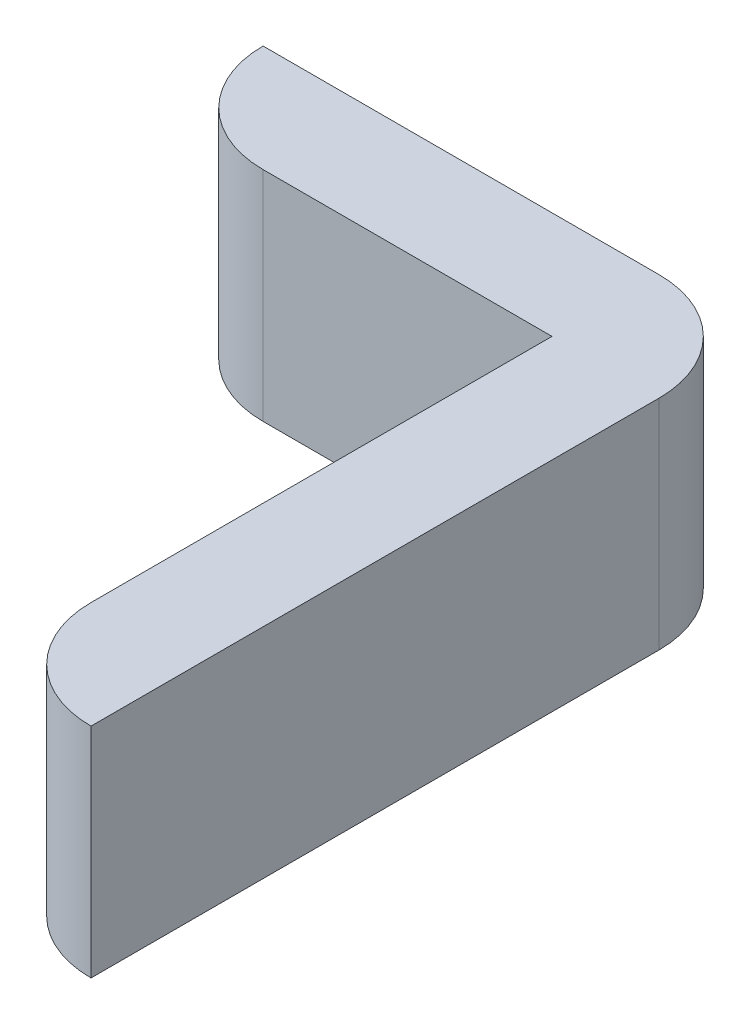
ISO-10303-21;
HEADER;
FILE_DESCRIPTION(('STEP AP214'),'2;1');
FILE_NAME('part.step','',(''),(''),'','','');
FILE_SCHEMA(('AUTOMOTIVE_DESIGN { 1 0 10303 214 1 1 1 1 }'));
ENDSEC;
DATA;
#1=APPLICATION_CONTEXT('core data for automotive mechanical design processes');
#2=APPLICATION_PROTOCOL_DEFINITION('international standard','automotive_design',2000,#1);
#3=PRODUCT_CONTEXT('',#1,'mechanical');
#4=PRODUCT('Part','Part','',(#3));
#5=PRODUCT_RELATED_PRODUCT_CATEGORY('part','',(#4));
#6=PRODUCT_DEFINITION_FORMATION('','',#4);
#7=PRODUCT_DEFINITION_CONTEXT('part definition',#1,'design');
#8=PRODUCT_DEFINITION('design','',#6,#7);
#9=PRODUCT_DEFINITION_SHAPE('','',#8);
#10=(LENGTH_UNIT() NAMED_UNIT(*) SI_UNIT(.MILLI.,.METRE.));
#11=(NAMED_UNIT(*) PLANE_ANGLE_UNIT() SI_UNIT($,.RADIAN.));
#12=(NAMED_UNIT(*) SI_UNIT($,.STERADIAN.) SOLID_ANGLE_UNIT());
#13=UNCERTAINTY_MEASURE_WITH_UNIT(LENGTH_MEASURE(1.E-05),#10,'distance_accuracy_value','');
#14=(GEOMETRIC_REPRESENTATION_CONTEXT(3) GLOBAL_UNCERTAINTY_ASSIGNED_CONTEXT((#13)) GLOBAL_UNIT_ASSIGNED_CONTEXT((#10,
#11,#12)) REPRESENTATION_CONTEXT('',''));
#15=CARTESIAN_POINT('',(0.,0.,0.));
#16=DIRECTION('',(0.,0.,1.));
#17=DIRECTION('',(1.,0.,0.));
#18=AXIS2_PLACEMENT_3D('',#15,#16,#17);
#19=CARTESIAN_POINT('',(9.275,-6.0952,0.));
#20=DIRECTION('',(0.,-1.,0.));
#21=DIRECTION('',(0.,0.,-1.));
#22=AXIS2_PLACEMENT_3D('',#19,#20,#21);
#23=PLANE('',#22);
#24=DIRECTION('',(-1.,0.,0.));
#25=VECTOR('',#24,1.);
#26=CARTESIAN_POINT('',(9.525,-6.0952,0.25));
#27=LINE('',#26,#25);
#28=CARTESIAN_POINT('',(9.525,-6.0952,0.25));
#29=VERTEX_POINT('',#28);
#30=CARTESIAN_POINT('',(10.2,-6.0952,0.25));
#31=VERTEX_POINT('',#30);
#32=EDGE_CURVE('E102',#29,#31,#27,.F.);
#33=ORIENTED_EDGE('',*,*,#32,.T.);
#34=DIRECTION('',(0.,0.,-1.));
#35=VECTOR('',#34,1.);
#36=CARTESIAN_POINT('',(10.2,-6.0952,0.25));
#37=LINE('',#36,#35);
#38=CARTESIAN_POINT('',(10.2,-6.0952,1.327));
#39=VERTEX_POINT('',#38);
#40=EDGE_CURVE('E108',#31,#39,#37,.F.);
#41=ORIENTED_EDGE('',*,*,#40,.T.);
#42=CARTESIAN_POINT('',(10.45,-6.0952,1.327));
#43=DIRECTION('',(0.,-1.,0.));
#44=DIRECTION('',(0.,0.,-1.));
#45=AXIS2_PLACEMENT_3D('',#42,#43,#44);
#46=CIRCLE('',#45,0.25);
#47=CARTESIAN_POINT('',(10.45,-6.0952,1.577));
#48=VERTEX_POINT('',#47);
#49=EDGE_CURVE('E80',#48,#39,#46,.T.);
#50=ORIENTED_EDGE('',*,*,#49,.F.);
#51=DIRECTION('',(0.,0.,1.));
#52=VECTOR('',#51,1.);
#53=CARTESIAN_POINT('',(10.45,-6.0952,1.577));
#54=LINE('',#53,#52);
#55=CARTESIAN_POINT('',(10.45,-6.0952,0.25));
#56=VERTEX_POINT('',#55);
#57=EDGE_CURVE('E75',#48,#56,#54,.F.);
#58=ORIENTED_EDGE('',*,*,#57,.T.);
#59=CARTESIAN_POINT('',(10.2,-6.0952,0.25));
#60=DIRECTION('',(0.,-1.,0.));
#61=DIRECTION('',(0.,0.,-1.));
#62=AXIS2_PLACEMENT_3D('',#59,#60,#61);
#63=CIRCLE('',#62,0.25);
#64=CARTESIAN_POINT('',(10.2,-6.0952,0.));
#65=VERTEX_POINT('',#64);
#66=EDGE_CURVE('E19',#65,#56,#63,.T.);
#67=ORIENTED_EDGE('',*,*,#66,.F.);
#68=DIRECTION('',(1.,0.,0.));
#69=VECTOR('',#68,1.);
#70=CARTESIAN_POINT('',(10.2,-6.0952,0.));
#71=LINE('',#70,#69);
#72=CARTESIAN_POINT('',(9.275,-6.0952,0.));
#73=VERTEX_POINT('',#72);
#74=EDGE_CURVE('E70',#65,#73,#71,.F.);
#75=ORIENTED_EDGE('',*,*,#74,.T.);
#76=CARTESIAN_POINT('',(9.525,-6.0952,0.));
#77=DIRECTION('',(0.,-1.,0.));
#78=DIRECTION('',(0.,0.,-1.));
#79=AXIS2_PLACEMENT_3D('',#76,#77,#78);
#80=CIRCLE('',#79,0.25);
#81=EDGE_CURVE('E121',#29,#73,#80,.T.);
#82=ORIENTED_EDGE('',*,*,#81,.F.);
#83=EDGE_LOOP('',(#33,#41,#50,#58,#67,#75,#82));
#84=FACE_BOUND('',#83,.T.);
#85=ADVANCED_FACE('F16',(#84),#23,.F.);
#86=CARTESIAN_POINT('',(10.2,-6.6048,0.));
#87=DIRECTION('',(0.,0.,1.));
#88=DIRECTION('',(1.,0.,0.));
#89=AXIS2_PLACEMENT_3D('',#86,#87,#88);
#90=PLANE('',#89);
#91=DIRECTION('',(0.,-1.,0.));
#92=VECTOR('',#91,1.);
#93=CARTESIAN_POINT('',(9.275,-6.6048,0.));
#94=LINE('',#93,#92);
#95=CARTESIAN_POINT('',(9.275,-6.6048,0.));
#96=VERTEX_POINT('',#95);
#97=EDGE_CURVE('E123',#73,#96,#94,.T.);
#98=ORIENTED_EDGE('',*,*,#97,.F.);
#99=ORIENTED_EDGE('',*,*,#74,.F.);
#100=DIRECTION('',(0.,-1.,0.));
#101=VECTOR('',#100,1.);
#102=CARTESIAN_POINT('',(10.2,-6.6048,0.));
#103=LINE('',#102,#101);
#104=CARTESIAN_POINT('',(10.2,-6.6048,0.));
#105=VERTEX_POINT('',#104);
#106=EDGE_CURVE('E92',#105,#65,#103,.F.);
#107=ORIENTED_EDGE('',*,*,#106,.F.);
#108=DIRECTION('',(1.,0.,0.));
#109=VECTOR('',#108,1.);
#110=CARTESIAN_POINT('',(9.275,-6.6048,0.));
#111=LINE('',#110,#109);
#112=EDGE_CURVE('E120',#96,#105,#111,.T.);
#113=ORIENTED_EDGE('',*,*,#112,.F.);
#114=EDGE_LOOP('',(#98,#99,#107,#113));
#115=FACE_BOUND('',#114,.T.);
#116=ADVANCED_FACE('F158',(#115),#90,.F.);
#117=CARTESIAN_POINT('',(10.2,-6.6048,0.25));
#118=DIRECTION('',(0.,-1.,0.));
#119=DIRECTION('',(0.,0.,-1.));
#120=AXIS2_PLACEMENT_3D('',#117,#118,#119);
#121=CYLINDRICAL_SURFACE('',#120,0.25);
#122=ORIENTED_EDGE('',*,*,#66,.T.);
#123=DIRECTION('',(0.,1.,0.));
#124=VECTOR('',#123,1.);
#125=CARTESIAN_POINT('',(10.45,-6.6048,0.25));
#126=LINE('',#125,#124);
#127=CARTESIAN_POINT('',(10.45,-6.6048,0.25));
#128=VERTEX_POINT('',#127);
#129=EDGE_CURVE('E86',#56,#128,#126,.F.);
#130=ORIENTED_EDGE('',*,*,#129,.T.);
#131=CARTESIAN_POINT('',(10.2,-6.6048,0.25));
#132=DIRECTION('',(0.,-1.,0.));
#133=DIRECTION('',(0.,0.,-1.));
#134=AXIS2_PLACEMENT_3D('',#131,#132,#133);
#135=CIRCLE('',#134,0.25);
#136=EDGE_CURVE('E118',#105,#128,#135,.T.);
#137=ORIENTED_EDGE('',*,*,#136,.F.);
#138=ORIENTED_EDGE('',*,*,#106,.T.);
#139=EDGE_LOOP('',(#122,#130,#137,#138));
#140=FACE_BOUND('',#139,.T.);
#141=ADVANCED_FACE('F89',(#140),#121,.T.);
#142=CARTESIAN_POINT('',(10.45,-6.6048,1.577));
#143=DIRECTION('',(-1.,0.,0.));
#144=DIRECTION('',(0.,0.,1.));
#145=AXIS2_PLACEMENT_3D('',#142,#143,#144);
#146=PLANE('',#145);
#147=DIRECTION('',(0.,-1.,0.));
#148=VECTOR('',#147,1.);
#149=CARTESIAN_POINT('',(10.45,-6.6048,1.577));
#150=LINE('',#149,#148);
#151=CARTESIAN_POINT('',(10.45,-6.6048,1.577));
#152=VERTEX_POINT('',#151);
#153=EDGE_CURVE('E85',#152,#48,#150,.F.);
#154=ORIENTED_EDGE('',*,*,#153,.F.);
#155=DIRECTION('',(0.,0.,-1.));
#156=VECTOR('',#155,1.);
#157=CARTESIAN_POINT('',(10.45,-6.6048,0.));
#158=LINE('',#157,#156);
#159=EDGE_CURVE('E94',#128,#152,#158,.F.);
#160=ORIENTED_EDGE('',*,*,#159,.F.);
#161=ORIENTED_EDGE('',*,*,#129,.F.);
#162=ORIENTED_EDGE('',*,*,#57,.F.);
#163=EDGE_LOOP('',(#154,#160,#161,#162));
#164=FACE_BOUND('',#163,.T.);
#165=ADVANCED_FACE('F93',(#164),#146,.F.);
#166=CARTESIAN_POINT('',(10.45,-6.6048,1.327));
#167=DIRECTION('',(0.,-1.,0.));
#168=DIRECTION('',(0.,0.,-1.));
#169=AXIS2_PLACEMENT_3D('',#166,#167,#168);
#170=CYLINDRICAL_SURFACE('',#169,0.25);
#171=ORIENTED_EDGE('',*,*,#49,.T.);
#172=DIRECTION('',(0.,1.,0.));
#173=VECTOR('',#172,1.);
#174=CARTESIAN_POINT('',(10.2,-6.6048,1.327));
#175=LINE('',#174,#173);
#176=CARTESIAN_POINT('',(10.2,-6.6048,1.327));
#177=VERTEX_POINT('',#176);
#178=EDGE_CURVE('E105',#39,#177,#175,.F.);
#179=ORIENTED_EDGE('',*,*,#178,.T.);
#180=CARTESIAN_POINT('',(10.45,-6.6048,1.327));
#181=DIRECTION('',(0.,-1.,0.));
#182=DIRECTION('',(0.,0.,-1.));
#183=AXIS2_PLACEMENT_3D('',#180,#181,#182);
#184=CIRCLE('',#183,0.25);
#185=EDGE_CURVE('E114',#152,#177,#184,.T.);
#186=ORIENTED_EDGE('',*,*,#185,.F.);
#187=ORIENTED_EDGE('',*,*,#153,.T.);
#188=EDGE_LOOP('',(#171,#179,#186,#187));
#189=FACE_BOUND('',#188,.T.);
#190=ADVANCED_FACE('F127',(#189),#170,.T.);
#191=CARTESIAN_POINT('',(10.2,-6.6048,0.25));
#192=DIRECTION('',(1.,0.,0.));
#193=DIRECTION('',(0.,0.,-1.));
#194=AXIS2_PLACEMENT_3D('',#191,#192,#193);
#195=PLANE('',#194);
#196=ORIENTED_EDGE('',*,*,#178,.F.);
#197=ORIENTED_EDGE('',*,*,#40,.F.);
#198=DIRECTION('',(0.,1.,0.));
#199=VECTOR('',#198,1.);
#200=CARTESIAN_POINT('',(10.2,-6.6048,0.25));
#201=LINE('',#200,#199);
#202=CARTESIAN_POINT('',(10.2,-6.6048,0.25));
#203=VERTEX_POINT('',#202);
#204=EDGE_CURVE('E104',#31,#203,#201,.F.);
#205=ORIENTED_EDGE('',*,*,#204,.T.);
#206=DIRECTION('',(0.,0.,-1.));
#207=VECTOR('',#206,1.);
#208=CARTESIAN_POINT('',(10.2,-6.6048,0.));
#209=LINE('',#208,#207);
#210=EDGE_CURVE('E117',#177,#203,#209,.T.);
#211=ORIENTED_EDGE('',*,*,#210,.F.);
#212=EDGE_LOOP('',(#196,#197,#205,#211));
#213=FACE_BOUND('',#212,.T.);
#214=ADVANCED_FACE('F150',(#213),#195,.F.);
#215=CARTESIAN_POINT('',(9.525,-6.6048,0.25));
#216=DIRECTION('',(0.,0.,-1.));
#217=DIRECTION('',(-1.,0.,0.));
#218=AXIS2_PLACEMENT_3D('',#215,#216,#217);
#219=PLANE('',#218);
#220=ORIENTED_EDGE('',*,*,#204,.F.);
#221=ORIENTED_EDGE('',*,*,#32,.F.);
#222=DIRECTION('',(0.,-1.,0.));
#223=VECTOR('',#222,1.);
#224=CARTESIAN_POINT('',(9.525,-6.6048,0.25));
#225=LINE('',#224,#223);
#226=CARTESIAN_POINT('',(9.525,-6.6048,0.25));
#227=VERTEX_POINT('',#226);
#228=EDGE_CURVE('E34',#227,#29,#225,.F.);
#229=ORIENTED_EDGE('',*,*,#228,.F.);
#230=DIRECTION('',(1.,0.,0.));
#231=VECTOR('',#230,1.);
#232=CARTESIAN_POINT('',(9.275,-6.6048,0.25));
#233=LINE('',#232,#231);
#234=EDGE_CURVE('E25',#203,#227,#233,.F.);
#235=ORIENTED_EDGE('',*,*,#234,.F.);
#236=EDGE_LOOP('',(#220,#221,#229,#235));
#237=FACE_BOUND('',#236,.T.);
#238=ADVANCED_FACE('F151',(#237),#219,.F.);
#239=CARTESIAN_POINT('',(9.525,-6.6048,0.));
#240=DIRECTION('',(0.,-1.,0.));
#241=DIRECTION('',(0.,0.,-1.));
#242=AXIS2_PLACEMENT_3D('',#239,#240,#241);
#243=CYLINDRICAL_SURFACE('',#242,0.25);
#244=ORIENTED_EDGE('',*,*,#81,.T.);
#245=ORIENTED_EDGE('',*,*,#97,.T.);
#246=CARTESIAN_POINT('',(9.525,-6.6048,0.));
#247=DIRECTION('',(0.,-1.,0.));
#248=DIRECTION('',(0.,0.,-1.));
#249=AXIS2_PLACEMENT_3D('',#246,#247,#248);
#250=CIRCLE('',#249,0.25);
#251=EDGE_CURVE('E11',#227,#96,#250,.T.);
#252=ORIENTED_EDGE('',*,*,#251,.F.);
#253=ORIENTED_EDGE('',*,*,#228,.T.);
#254=EDGE_LOOP('',(#244,#245,#252,#253));
#255=FACE_BOUND('',#254,.T.);
#256=ADVANCED_FACE('F156',(#255),#243,.T.);
#257=CARTESIAN_POINT('',(9.275,-6.6048,0.));
#258=DIRECTION('',(0.,-1.,0.));
#259=DIRECTION('',(0.,0.,-1.));
#260=AXIS2_PLACEMENT_3D('',#257,#258,#259);
#261=PLANE('',#260);
#262=ORIENTED_EDGE('',*,*,#234,.T.);
#263=ORIENTED_EDGE('',*,*,#251,.T.);
#264=ORIENTED_EDGE('',*,*,#112,.T.);
#265=ORIENTED_EDGE('',*,*,#136,.T.);
#266=ORIENTED_EDGE('',*,*,#159,.T.);
#267=ORIENTED_EDGE('',*,*,#185,.T.);
#268=ORIENTED_EDGE('',*,*,#210,.T.);
#269=EDGE_LOOP('',(#262,#263,#264,#265,#266,#267,#268));
#270=FACE_BOUND('',#269,.T.);
#271=ADVANCED_FACE('F132',(#270),#261,.T.);
#272=CLOSED_SHELL('',(#85,#116,#141,#165,#190,#214,#238,#256,#271));
#273=MANIFOLD_SOLID_BREP('B1',#272);
#274=ADVANCED_BREP_SHAPE_REPRESENTATION('',(#18,#273),#14);
#275=SHAPE_DEFINITION_REPRESENTATION(#9,#274);
ENDSEC;
END-ISO-10303-21;
